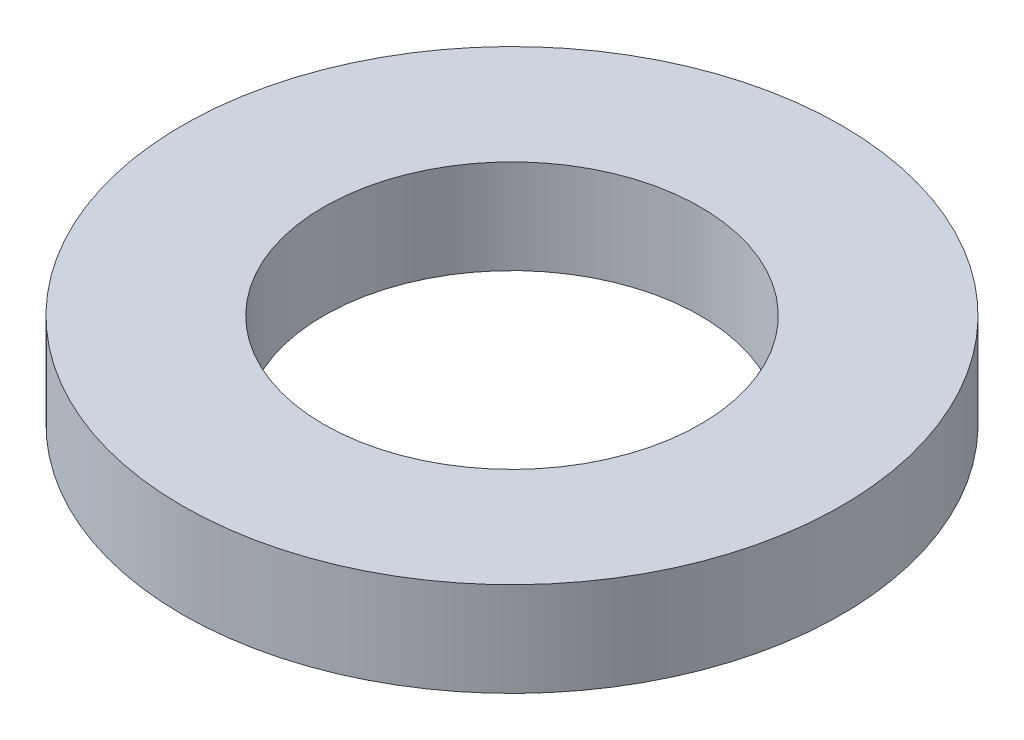
ISO-10303-21;
HEADER;
FILE_DESCRIPTION(('STEP AP214'),'2;1');
FILE_NAME('part.step','',(''),(''),'','','');
FILE_SCHEMA(('AUTOMOTIVE_DESIGN { 1 0 10303 214 1 1 1 1 }'));
ENDSEC;
DATA;
#1=APPLICATION_CONTEXT('core data for automotive mechanical design processes');
#2=APPLICATION_PROTOCOL_DEFINITION('international standard','automotive_design',2000,#1);
#3=PRODUCT_CONTEXT('',#1,'mechanical');
#4=PRODUCT('Part','Part','',(#3));
#5=PRODUCT_RELATED_PRODUCT_CATEGORY('part','',(#4));
#6=PRODUCT_DEFINITION_FORMATION('','',#4);
#7=PRODUCT_DEFINITION_CONTEXT('part definition',#1,'design');
#8=PRODUCT_DEFINITION('design','',#6,#7);
#9=PRODUCT_DEFINITION_SHAPE('','',#8);
#10=(LENGTH_UNIT() NAMED_UNIT(*) SI_UNIT(.MILLI.,.METRE.));
#11=(NAMED_UNIT(*) PLANE_ANGLE_UNIT() SI_UNIT($,.RADIAN.));
#12=(NAMED_UNIT(*) SI_UNIT($,.STERADIAN.) SOLID_ANGLE_UNIT());
#13=UNCERTAINTY_MEASURE_WITH_UNIT(LENGTH_MEASURE(1.E-05),#10,'distance_accuracy_value','');
#14=(GEOMETRIC_REPRESENTATION_CONTEXT(3) GLOBAL_UNCERTAINTY_ASSIGNED_CONTEXT((#13)) GLOBAL_UNIT_ASSIGNED_CONTEXT((#10,
#11,#12)) REPRESENTATION_CONTEXT('',''));
#15=CARTESIAN_POINT('',(0.,0.,0.));
#16=DIRECTION('',(0.,0.,1.));
#17=DIRECTION('',(1.,0.,0.));
#18=AXIS2_PLACEMENT_3D('',#15,#16,#17);
#19=CARTESIAN_POINT('',(0.,15.,0.));
#20=DIRECTION('',(0.,-1.,0.));
#21=DIRECTION('',(0.,0.,-1.));
#22=AXIS2_PLACEMENT_3D('',#19,#20,#21);
#23=CYLINDRICAL_SURFACE('',#22,52.5);
#24=CARTESIAN_POINT('',(0.,15.,0.));
#25=DIRECTION('',(0.,1.,0.));
#26=DIRECTION('',(0.,0.,1.));
#27=AXIS2_PLACEMENT_3D('',#24,#25,#26);
#28=CIRCLE('',#27,52.5);
#29=CARTESIAN_POINT('',(0.,15.,52.5));
#30=VERTEX_POINT('',#29);
#31=EDGE_CURVE('E10',#30,#30,#28,.T.);
#32=ORIENTED_EDGE('',*,*,#31,.F.);
#33=EDGE_LOOP('',(#32));
#34=FACE_BOUND('',#33,.T.);
#35=CARTESIAN_POINT('',(0.,0.,0.));
#36=DIRECTION('',(0.,1.,0.));
#37=DIRECTION('',(0.,0.,1.));
#38=AXIS2_PLACEMENT_3D('',#35,#36,#37);
#39=CIRCLE('',#38,52.5);
#40=CARTESIAN_POINT('',(0.,0.,52.5));
#41=VERTEX_POINT('',#40);
#42=EDGE_CURVE('E37',#41,#41,#39,.T.);
#43=ORIENTED_EDGE('',*,*,#42,.T.);
#44=EDGE_LOOP('',(#43));
#45=FACE_BOUND('',#44,.T.);
#46=ADVANCED_FACE('F40',(#34,#45),#23,.T.);
#47=CARTESIAN_POINT('',(0.,15.,0.));
#48=DIRECTION('',(0.,1.,0.));
#49=DIRECTION('',(0.,0.,1.));
#50=AXIS2_PLACEMENT_3D('',#47,#48,#49);
#51=PLANE('',#50);
#52=CARTESIAN_POINT('',(0.,15.,0.));
#53=DIRECTION('',(0.,1.,0.));
#54=DIRECTION('',(0.,0.,1.));
#55=AXIS2_PLACEMENT_3D('',#52,#53,#54);
#56=CIRCLE('',#55,30.);
#57=CARTESIAN_POINT('',(0.,15.,30.));
#58=VERTEX_POINT('',#57);
#59=EDGE_CURVE('E50',#58,#58,#56,.T.);
#60=ORIENTED_EDGE('',*,*,#59,.F.);
#61=EDGE_LOOP('',(#60));
#62=FACE_BOUND('',#61,.T.);
#63=ORIENTED_EDGE('',*,*,#31,.T.);
#64=EDGE_LOOP('',(#63));
#65=FACE_BOUND('',#64,.T.);
#66=ADVANCED_FACE('F59',(#62,#65),#51,.T.);
#67=CARTESIAN_POINT('',(0.,0.,0.));
#68=DIRECTION('',(0.,1.,0.));
#69=DIRECTION('',(0.,0.,1.));
#70=AXIS2_PLACEMENT_3D('',#67,#68,#69);
#71=PLANE('',#70);
#72=CARTESIAN_POINT('',(0.,0.,0.));
#73=DIRECTION('',(0.,1.,0.));
#74=DIRECTION('',(0.,0.,1.));
#75=AXIS2_PLACEMENT_3D('',#72,#73,#74);
#76=CIRCLE('',#75,30.);
#77=CARTESIAN_POINT('',(0.,0.,30.));
#78=VERTEX_POINT('',#77);
#79=EDGE_CURVE('E47',#78,#78,#76,.T.);
#80=ORIENTED_EDGE('',*,*,#79,.T.);
#81=EDGE_LOOP('',(#80));
#82=FACE_BOUND('',#81,.T.);
#83=ORIENTED_EDGE('',*,*,#42,.F.);
#84=EDGE_LOOP('',(#83));
#85=FACE_BOUND('',#84,.T.);
#86=ADVANCED_FACE('F58',(#82,#85),#71,.F.);
#87=CARTESIAN_POINT('',(0.,15.,0.));
#88=DIRECTION('',(0.,-1.,0.));
#89=DIRECTION('',(0.,0.,-1.));
#90=AXIS2_PLACEMENT_3D('',#87,#88,#89);
#91=CYLINDRICAL_SURFACE('',#90,30.);
#92=ORIENTED_EDGE('',*,*,#59,.T.);
#93=EDGE_LOOP('',(#92));
#94=FACE_BOUND('',#93,.T.);
#95=ORIENTED_EDGE('',*,*,#79,.F.);
#96=EDGE_LOOP('',(#95));
#97=FACE_BOUND('',#96,.T.);
#98=ADVANCED_FACE('F54',(#94,#97),#91,.F.);
#99=CLOSED_SHELL('',(#46,#66,#86,#98));
#100=MANIFOLD_SOLID_BREP('B2',#99);
#101=ADVANCED_BREP_SHAPE_REPRESENTATION('',(#18,#100),#14);
#102=SHAPE_DEFINITION_REPRESENTATION(#9,#101);
ENDSEC;
END-ISO-10303-21;
